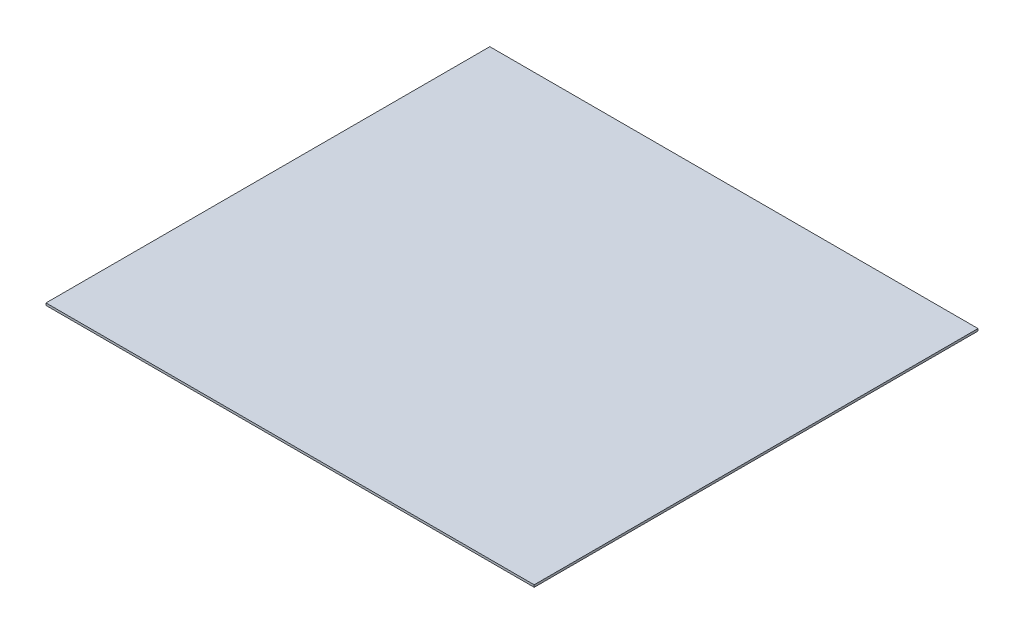
ISO-10303-21;
HEADER;
FILE_DESCRIPTION(('STEP AP214'),'2;1');
FILE_NAME('part.step','',(''),(''),'','','');
FILE_SCHEMA(('AUTOMOTIVE_DESIGN { 1 0 10303 214 1 1 1 1 }'));
ENDSEC;
DATA;
#1=APPLICATION_CONTEXT('core data for automotive mechanical design processes');
#2=APPLICATION_PROTOCOL_DEFINITION('international standard','automotive_design',2000,#1);
#3=PRODUCT_CONTEXT('',#1,'mechanical');
#4=PRODUCT('Part','Part','',(#3));
#5=PRODUCT_RELATED_PRODUCT_CATEGORY('part','',(#4));
#6=PRODUCT_DEFINITION_FORMATION('','',#4);
#7=PRODUCT_DEFINITION_CONTEXT('part definition',#1,'design');
#8=PRODUCT_DEFINITION('design','',#6,#7);
#9=PRODUCT_DEFINITION_SHAPE('','',#8);
#10=(LENGTH_UNIT() NAMED_UNIT(*) SI_UNIT(.MILLI.,.METRE.));
#11=(NAMED_UNIT(*) PLANE_ANGLE_UNIT() SI_UNIT($,.RADIAN.));
#12=(NAMED_UNIT(*) SI_UNIT($,.STERADIAN.) SOLID_ANGLE_UNIT());
#13=UNCERTAINTY_MEASURE_WITH_UNIT(LENGTH_MEASURE(1.E-05),#10,'distance_accuracy_value','');
#14=(GEOMETRIC_REPRESENTATION_CONTEXT(3) GLOBAL_UNCERTAINTY_ASSIGNED_CONTEXT((#13)) GLOBAL_UNIT_ASSIGNED_CONTEXT((#10,
#11,#12)) REPRESENTATION_CONTEXT('',''));
#15=CARTESIAN_POINT('',(0.,0.,0.));
#16=DIRECTION('',(0.,0.,1.));
#17=DIRECTION('',(1.,0.,0.));
#18=AXIS2_PLACEMENT_3D('',#15,#16,#17);
#19=CARTESIAN_POINT('',(0.,10.,0.));
#20=DIRECTION('',(1.,0.,0.));
#21=DIRECTION('',(0.,0.,-1.));
#22=AXIS2_PLACEMENT_3D('',#19,#20,#21);
#23=PLANE('',#22);
#24=DIRECTION('',(0.,0.,1.));
#25=VECTOR('',#24,1.);
#26=CARTESIAN_POINT('',(0.,0.,0.));
#27=LINE('',#26,#25);
#28=CARTESIAN_POINT('',(0.,0.,-2000.));
#29=VERTEX_POINT('',#28);
#30=CARTESIAN_POINT('',(0.,0.,0.));
#31=VERTEX_POINT('',#30);
#32=EDGE_CURVE('E95',#29,#31,#27,.T.);
#33=ORIENTED_EDGE('',*,*,#32,.T.);
#34=DIRECTION('',(0.,-1.,0.));
#35=VECTOR('',#34,1.);
#36=CARTESIAN_POINT('',(0.,10.,0.));
#37=LINE('',#36,#35);
#38=CARTESIAN_POINT('',(0.,10.,0.));
#39=VERTEX_POINT('',#38);
#40=EDGE_CURVE('E11',#39,#31,#37,.T.);
#41=ORIENTED_EDGE('',*,*,#40,.F.);
#42=DIRECTION('',(0.,0.,1.));
#43=VECTOR('',#42,1.);
#44=CARTESIAN_POINT('',(0.,10.,0.));
#45=LINE('',#44,#43);
#46=CARTESIAN_POINT('',(0.,10.,-2000.));
#47=VERTEX_POINT('',#46);
#48=EDGE_CURVE('E83',#47,#39,#45,.T.);
#49=ORIENTED_EDGE('',*,*,#48,.F.);
#50=DIRECTION('',(0.,-1.,0.));
#51=VECTOR('',#50,1.);
#52=CARTESIAN_POINT('',(0.,10.,-2000.));
#53=LINE('',#52,#51);
#54=EDGE_CURVE('E91',#47,#29,#53,.T.);
#55=ORIENTED_EDGE('',*,*,#54,.T.);
#56=EDGE_LOOP('',(#33,#41,#49,#55));
#57=FACE_BOUND('',#56,.T.);
#58=ADVANCED_FACE('F32',(#57),#23,.F.);
#59=CARTESIAN_POINT('',(0.,10.,0.));
#60=DIRECTION('',(0.,0.,-1.));
#61=DIRECTION('',(-1.,0.,0.));
#62=AXIS2_PLACEMENT_3D('',#59,#60,#61);
#63=PLANE('',#62);
#64=DIRECTION('',(1.,0.,0.));
#65=VECTOR('',#64,1.);
#66=CARTESIAN_POINT('',(0.,0.,0.));
#67=LINE('',#66,#65);
#68=CARTESIAN_POINT('',(2200.,0.,0.));
#69=VERTEX_POINT('',#68);
#70=EDGE_CURVE('E87',#31,#69,#67,.T.);
#71=ORIENTED_EDGE('',*,*,#70,.T.);
#72=DIRECTION('',(0.,-1.,0.));
#73=VECTOR('',#72,1.);
#74=CARTESIAN_POINT('',(2200.,10.,0.));
#75=LINE('',#74,#73);
#76=CARTESIAN_POINT('',(2200.,10.,0.));
#77=VERTEX_POINT('',#76);
#78=EDGE_CURVE('E40',#77,#69,#75,.T.);
#79=ORIENTED_EDGE('',*,*,#78,.F.);
#80=DIRECTION('',(1.,0.,0.));
#81=VECTOR('',#80,1.);
#82=CARTESIAN_POINT('',(0.,10.,0.));
#83=LINE('',#82,#81);
#84=EDGE_CURVE('E78',#39,#77,#83,.T.);
#85=ORIENTED_EDGE('',*,*,#84,.F.);
#86=ORIENTED_EDGE('',*,*,#40,.T.);
#87=EDGE_LOOP('',(#71,#79,#85,#86));
#88=FACE_BOUND('',#87,.T.);
#89=ADVANCED_FACE('F86',(#88),#63,.F.);
#90=CARTESIAN_POINT('',(2200.,10.,0.));
#91=DIRECTION('',(-1.,0.,0.));
#92=DIRECTION('',(0.,0.,1.));
#93=AXIS2_PLACEMENT_3D('',#90,#91,#92);
#94=PLANE('',#93);
#95=DIRECTION('',(0.,0.,-1.));
#96=VECTOR('',#95,1.);
#97=CARTESIAN_POINT('',(2200.,0.,0.));
#98=LINE('',#97,#96);
#99=CARTESIAN_POINT('',(2200.,0.,-2000.));
#100=VERTEX_POINT('',#99);
#101=EDGE_CURVE('E65',#69,#100,#98,.T.);
#102=ORIENTED_EDGE('',*,*,#101,.T.);
#103=DIRECTION('',(0.,-1.,0.));
#104=VECTOR('',#103,1.);
#105=CARTESIAN_POINT('',(2200.,10.,-2000.));
#106=LINE('',#105,#104);
#107=CARTESIAN_POINT('',(2200.,10.,-2000.));
#108=VERTEX_POINT('',#107);
#109=EDGE_CURVE('E88',#108,#100,#106,.T.);
#110=ORIENTED_EDGE('',*,*,#109,.F.);
#111=DIRECTION('',(0.,0.,-1.));
#112=VECTOR('',#111,1.);
#113=CARTESIAN_POINT('',(2200.,10.,0.));
#114=LINE('',#113,#112);
#115=EDGE_CURVE('E81',#77,#108,#114,.T.);
#116=ORIENTED_EDGE('',*,*,#115,.F.);
#117=ORIENTED_EDGE('',*,*,#78,.T.);
#118=EDGE_LOOP('',(#102,#110,#116,#117));
#119=FACE_BOUND('',#118,.T.);
#120=ADVANCED_FACE('F89',(#119),#94,.F.);
#121=CARTESIAN_POINT('',(0.,10.,-2000.));
#122=DIRECTION('',(0.,0.,1.));
#123=DIRECTION('',(1.,0.,0.));
#124=AXIS2_PLACEMENT_3D('',#121,#122,#123);
#125=PLANE('',#124);
#126=DIRECTION('',(-1.,0.,0.));
#127=VECTOR('',#126,1.);
#128=CARTESIAN_POINT('',(0.,0.,-2000.));
#129=LINE('',#128,#127);
#130=EDGE_CURVE('E71',#100,#29,#129,.T.);
#131=ORIENTED_EDGE('',*,*,#130,.T.);
#132=ORIENTED_EDGE('',*,*,#54,.F.);
#133=DIRECTION('',(-1.,0.,0.));
#134=VECTOR('',#133,1.);
#135=CARTESIAN_POINT('',(0.,10.,-2000.));
#136=LINE('',#135,#134);
#137=EDGE_CURVE('E48',#108,#47,#136,.T.);
#138=ORIENTED_EDGE('',*,*,#137,.F.);
#139=ORIENTED_EDGE('',*,*,#109,.T.);
#140=EDGE_LOOP('',(#131,#132,#138,#139));
#141=FACE_BOUND('',#140,.T.);
#142=ADVANCED_FACE('F102',(#141),#125,.F.);
#143=CARTESIAN_POINT('',(0.,10.,-2000.));
#144=DIRECTION('',(0.,-1.,0.));
#145=DIRECTION('',(0.,0.,-1.));
#146=AXIS2_PLACEMENT_3D('',#143,#144,#145);
#147=PLANE('',#146);
#148=ORIENTED_EDGE('',*,*,#48,.T.);
#149=ORIENTED_EDGE('',*,*,#84,.T.);
#150=ORIENTED_EDGE('',*,*,#115,.T.);
#151=ORIENTED_EDGE('',*,*,#137,.T.);
#152=EDGE_LOOP('',(#148,#149,#150,#151));
#153=FACE_BOUND('',#152,.T.);
#154=ADVANCED_FACE('F79',(#153),#147,.F.);
#155=CARTESIAN_POINT('',(0.,0.,-2000.));
#156=DIRECTION('',(0.,-1.,0.));
#157=DIRECTION('',(0.,0.,-1.));
#158=AXIS2_PLACEMENT_3D('',#155,#156,#157);
#159=PLANE('',#158);
#160=ORIENTED_EDGE('',*,*,#32,.F.);
#161=ORIENTED_EDGE('',*,*,#130,.F.);
#162=ORIENTED_EDGE('',*,*,#101,.F.);
#163=ORIENTED_EDGE('',*,*,#70,.F.);
#164=EDGE_LOOP('',(#160,#161,#162,#163));
#165=FACE_BOUND('',#164,.T.);
#166=ADVANCED_FACE('F105',(#165),#159,.T.);
#167=CLOSED_SHELL('',(#58,#89,#120,#142,#154,#166));
#168=MANIFOLD_SOLID_BREP('B2',#167);
#169=ADVANCED_BREP_SHAPE_REPRESENTATION('',(#18,#168),#14);
#170=SHAPE_DEFINITION_REPRESENTATION(#9,#169);
ENDSEC;
END-ISO-10303-21;
